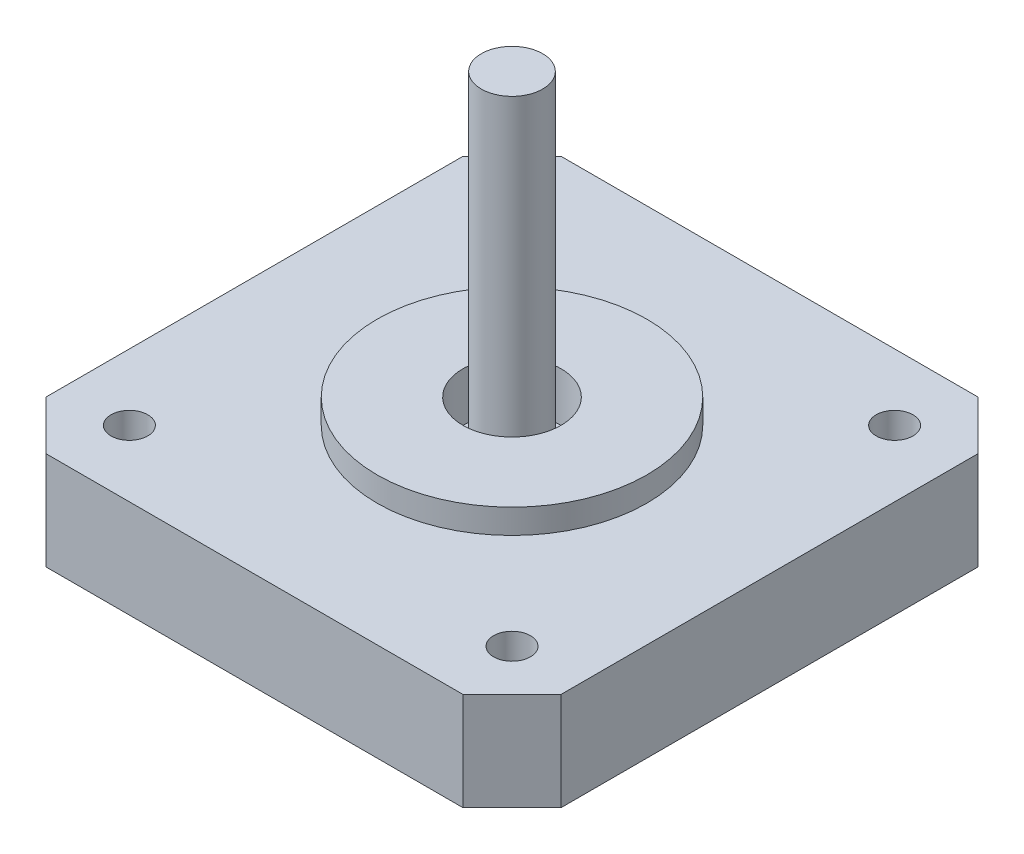
ISO-10303-21;
HEADER;
FILE_DESCRIPTION(('STEP AP214'),'2;1');
FILE_NAME('part.step','',(''),(''),'','','');
FILE_SCHEMA(('AUTOMOTIVE_DESIGN { 1 0 10303 214 1 1 1 1 }'));
ENDSEC;
DATA;
#1=APPLICATION_CONTEXT('core data for automotive mechanical design processes');
#2=APPLICATION_PROTOCOL_DEFINITION('international standard','automotive_design',2000,#1);
#3=PRODUCT_CONTEXT('',#1,'mechanical');
#4=PRODUCT('Part','Part','',(#3));
#5=PRODUCT_RELATED_PRODUCT_CATEGORY('part','',(#4));
#6=PRODUCT_DEFINITION_FORMATION('','',#4);
#7=PRODUCT_DEFINITION_CONTEXT('part definition',#1,'design');
#8=PRODUCT_DEFINITION('design','',#6,#7);
#9=PRODUCT_DEFINITION_SHAPE('','',#8);
#10=(LENGTH_UNIT() NAMED_UNIT(*) SI_UNIT(.MILLI.,.METRE.));
#11=(NAMED_UNIT(*) PLANE_ANGLE_UNIT() SI_UNIT($,.RADIAN.));
#12=(NAMED_UNIT(*) SI_UNIT($,.STERADIAN.) SOLID_ANGLE_UNIT());
#13=UNCERTAINTY_MEASURE_WITH_UNIT(LENGTH_MEASURE(1.E-05),#10,'distance_accuracy_value','');
#14=(GEOMETRIC_REPRESENTATION_CONTEXT(3) GLOBAL_UNCERTAINTY_ASSIGNED_CONTEXT((#13)) GLOBAL_UNIT_ASSIGNED_CONTEXT((#10,
#11,#12)) REPRESENTATION_CONTEXT('',''));
#15=CARTESIAN_POINT('',(0.,0.,0.));
#16=DIRECTION('',(0.,0.,1.));
#17=DIRECTION('',(1.,0.,0.));
#18=AXIS2_PLACEMENT_3D('',#15,#16,#17);
#19=CARTESIAN_POINT('',(0.,6.,0.));
#20=DIRECTION('',(0.,1.,0.));
#21=DIRECTION('',(0.,0.,1.));
#22=AXIS2_PLACEMENT_3D('',#19,#20,#21);
#23=PLANE('',#22);
#24=CARTESIAN_POINT('',(0.,6.,0.));
#25=DIRECTION('',(0.,1.,0.));
#26=DIRECTION('',(0.,0.,1.));
#27=AXIS2_PLACEMENT_3D('',#24,#25,#26);
#28=CIRCLE('',#27,4.);
#29=CARTESIAN_POINT('',(0.,6.,4.));
#30=VERTEX_POINT('',#29);
#31=EDGE_CURVE('E182',#30,#30,#28,.T.);
#32=ORIENTED_EDGE('',*,*,#31,.T.);
#33=EDGE_LOOP('',(#32));
#34=FACE_BOUND('',#33,.T.);
#35=CARTESIAN_POINT('',(0.,6.,0.));
#36=DIRECTION('',(0.,1.,0.));
#37=DIRECTION('',(0.,0.,1.));
#38=AXIS2_PLACEMENT_3D('',#35,#36,#37);
#39=CIRCLE('',#38,2.5);
#40=CARTESIAN_POINT('',(0.,6.,2.5));
#41=VERTEX_POINT('',#40);
#42=EDGE_CURVE('E190',#41,#41,#39,.T.);
#43=ORIENTED_EDGE('',*,*,#42,.F.);
#44=EDGE_LOOP('',(#43));
#45=FACE_BOUND('',#44,.T.);
#46=ADVANCED_FACE('F35',(#34,#45),#23,.T.);
#47=CARTESIAN_POINT('',(-21.,8.,21.));
#48=DIRECTION('',(0.,1.,0.));
#49=DIRECTION('',(0.,0.,1.));
#50=AXIS2_PLACEMENT_3D('',#47,#48,#49);
#51=PLANE('',#50);
#52=CARTESIAN_POINT('',(-15.6,8.,15.6));
#53=DIRECTION('',(0.,1.,0.));
#54=DIRECTION('',(0.,0.,1.));
#55=AXIS2_PLACEMENT_3D('',#52,#53,#54);
#56=CIRCLE('',#55,1.5);
#57=CARTESIAN_POINT('',(-15.6,8.,17.1));
#58=VERTEX_POINT('',#57);
#59=EDGE_CURVE('E213',#58,#58,#56,.T.);
#60=ORIENTED_EDGE('',*,*,#59,.F.);
#61=EDGE_LOOP('',(#60));
#62=FACE_BOUND('',#61,.T.);
#63=CARTESIAN_POINT('',(15.6,8.,15.6));
#64=DIRECTION('',(0.,1.,0.));
#65=DIRECTION('',(0.,0.,1.));
#66=AXIS2_PLACEMENT_3D('',#63,#64,#65);
#67=CIRCLE('',#66,1.5);
#68=CARTESIAN_POINT('',(15.6,8.,17.1));
#69=VERTEX_POINT('',#68);
#70=EDGE_CURVE('E207',#69,#69,#67,.T.);
#71=ORIENTED_EDGE('',*,*,#70,.F.);
#72=EDGE_LOOP('',(#71));
#73=FACE_BOUND('',#72,.T.);
#74=CARTESIAN_POINT('',(15.6,8.,-15.6));
#75=DIRECTION('',(0.,1.,0.));
#76=DIRECTION('',(0.,0.,1.));
#77=AXIS2_PLACEMENT_3D('',#74,#75,#76);
#78=CIRCLE('',#77,1.5);
#79=CARTESIAN_POINT('',(15.6,8.,-14.1));
#80=VERTEX_POINT('',#79);
#81=EDGE_CURVE('E201',#80,#80,#78,.T.);
#82=ORIENTED_EDGE('',*,*,#81,.F.);
#83=EDGE_LOOP('',(#82));
#84=FACE_BOUND('',#83,.T.);
#85=CARTESIAN_POINT('',(-15.6,8.,-15.6));
#86=DIRECTION('',(0.,1.,0.));
#87=DIRECTION('',(0.,0.,1.));
#88=AXIS2_PLACEMENT_3D('',#85,#86,#87);
#89=CIRCLE('',#88,1.5);
#90=CARTESIAN_POINT('',(-15.6,8.,-14.1));
#91=VERTEX_POINT('',#90);
#92=EDGE_CURVE('E193',#91,#91,#89,.T.);
#93=ORIENTED_EDGE('',*,*,#92,.F.);
#94=EDGE_LOOP('',(#93));
#95=FACE_BOUND('',#94,.T.);
#96=DIRECTION('',(-1.,0.,0.));
#97=VECTOR('',#96,1.);
#98=CARTESIAN_POINT('',(-21.,8.,-21.));
#99=LINE('',#98,#97);
#100=CARTESIAN_POINT('',(17.,8.,-21.));
#101=VERTEX_POINT('',#100);
#102=CARTESIAN_POINT('',(-17.,8.,-21.));
#103=VERTEX_POINT('',#102);
#104=EDGE_CURVE('E137',#101,#103,#99,.T.);
#105=ORIENTED_EDGE('',*,*,#104,.T.);
#106=DIRECTION('',(0.707106781186549,0.,-0.707106781186546));
#107=VECTOR('',#106,1.);
#108=CARTESIAN_POINT('',(-40.,8.,1.99999999999993));
#109=LINE('',#108,#107);
#110=CARTESIAN_POINT('',(-21.,8.,-17.));
#111=VERTEX_POINT('',#110);
#112=EDGE_CURVE('E156',#103,#111,#109,.F.);
#113=ORIENTED_EDGE('',*,*,#112,.T.);
#114=DIRECTION('',(0.,0.,1.));
#115=VECTOR('',#114,1.);
#116=CARTESIAN_POINT('',(-21.,8.,-21.));
#117=LINE('',#116,#115);
#118=CARTESIAN_POINT('',(-21.,8.,17.));
#119=VERTEX_POINT('',#118);
#120=EDGE_CURVE('E121',#111,#119,#117,.T.);
#121=ORIENTED_EDGE('',*,*,#120,.T.);
#122=DIRECTION('',(-0.707106781186546,0.,-0.707106781186549));
#123=VECTOR('',#122,1.);
#124=CARTESIAN_POINT('',(-19.,8.,19.));
#125=LINE('',#124,#123);
#126=CARTESIAN_POINT('',(-17.,8.,21.));
#127=VERTEX_POINT('',#126);
#128=EDGE_CURVE('E151',#119,#127,#125,.F.);
#129=ORIENTED_EDGE('',*,*,#128,.T.);
#130=DIRECTION('',(1.,0.,0.));
#131=VECTOR('',#130,1.);
#132=CARTESIAN_POINT('',(-21.,8.,21.));
#133=LINE('',#132,#131);
#134=CARTESIAN_POINT('',(17.,8.,21.));
#135=VERTEX_POINT('',#134);
#136=EDGE_CURVE('E167',#127,#135,#133,.T.);
#137=ORIENTED_EDGE('',*,*,#136,.T.);
#138=DIRECTION('',(-0.707106781186549,0.,0.707106781186546));
#139=VECTOR('',#138,1.);
#140=CARTESIAN_POINT('',(-2.00000000000007,8.,40.));
#141=LINE('',#140,#139);
#142=CARTESIAN_POINT('',(21.,8.,17.));
#143=VERTEX_POINT('',#142);
#144=EDGE_CURVE('E57',#135,#143,#141,.F.);
#145=ORIENTED_EDGE('',*,*,#144,.T.);
#146=DIRECTION('',(0.,0.,-1.));
#147=VECTOR('',#146,1.);
#148=CARTESIAN_POINT('',(21.,8.,-21.));
#149=LINE('',#148,#147);
#150=CARTESIAN_POINT('',(21.,8.,-17.));
#151=VERTEX_POINT('',#150);
#152=EDGE_CURVE('E175',#143,#151,#149,.T.);
#153=ORIENTED_EDGE('',*,*,#152,.T.);
#154=DIRECTION('',(0.707106781186546,0.,0.707106781186549));
#155=VECTOR('',#154,1.);
#156=CARTESIAN_POINT('',(19.0000000000001,8.,-18.9999999999999));
#157=LINE('',#156,#155);
#158=EDGE_CURVE('E154',#151,#101,#157,.F.);
#159=ORIENTED_EDGE('',*,*,#158,.T.);
#160=EDGE_LOOP('',(#105,#113,#121,#129,#137,#145,#153,#159));
#161=FACE_BOUND('',#160,.T.);
#162=CARTESIAN_POINT('',(0.,8.,0.));
#163=DIRECTION('',(0.,1.,0.));
#164=DIRECTION('',(0.,0.,1.));
#165=AXIS2_PLACEMENT_3D('',#162,#163,#164);
#166=CIRCLE('',#165,11.);
#167=CARTESIAN_POINT('',(0.,8.,11.));
#168=VERTEX_POINT('',#167);
#169=EDGE_CURVE('E134',#168,#168,#166,.T.);
#170=ORIENTED_EDGE('',*,*,#169,.F.);
#171=EDGE_LOOP('',(#170));
#172=FACE_BOUND('',#171,.T.);
#173=ADVANCED_FACE('F234',(#62,#73,#84,#95,#161,#172),#51,.T.);
#174=CARTESIAN_POINT('',(-21.,8.,-21.));
#175=DIRECTION('',(1.,0.,0.));
#176=DIRECTION('',(0.,0.,-1.));
#177=AXIS2_PLACEMENT_3D('',#174,#175,#176);
#178=PLANE('',#177);
#179=ORIENTED_EDGE('',*,*,#120,.F.);
#180=DIRECTION('',(0.,-1.,0.));
#181=VECTOR('',#180,1.);
#182=CARTESIAN_POINT('',(-21.,8.,-17.));
#183=LINE('',#182,#181);
#184=CARTESIAN_POINT('',(-21.,0.,-17.));
#185=VERTEX_POINT('',#184);
#186=EDGE_CURVE('E105',#111,#185,#183,.T.);
#187=ORIENTED_EDGE('',*,*,#186,.T.);
#188=DIRECTION('',(0.,0.,1.));
#189=VECTOR('',#188,1.);
#190=CARTESIAN_POINT('',(-21.,0.,-21.));
#191=LINE('',#190,#189);
#192=CARTESIAN_POINT('',(-21.,0.,17.));
#193=VERTEX_POINT('',#192);
#194=EDGE_CURVE('E118',#185,#193,#191,.T.);
#195=ORIENTED_EDGE('',*,*,#194,.T.);
#196=DIRECTION('',(0.,1.,0.));
#197=VECTOR('',#196,1.);
#198=CARTESIAN_POINT('',(-21.,8.,17.));
#199=LINE('',#198,#197);
#200=EDGE_CURVE('E123',#193,#119,#199,.T.);
#201=ORIENTED_EDGE('',*,*,#200,.T.);
#202=EDGE_LOOP('',(#179,#187,#195,#201));
#203=FACE_BOUND('',#202,.T.);
#204=ADVANCED_FACE('F117',(#203),#178,.F.);
#205=CARTESIAN_POINT('',(-21.,8.,21.));
#206=DIRECTION('',(0.,0.,-1.));
#207=DIRECTION('',(-1.,0.,0.));
#208=AXIS2_PLACEMENT_3D('',#205,#206,#207);
#209=PLANE('',#208);
#210=DIRECTION('',(1.,0.,0.));
#211=VECTOR('',#210,1.);
#212=CARTESIAN_POINT('',(-21.,0.,21.));
#213=LINE('',#212,#211);
#214=CARTESIAN_POINT('',(-17.,0.,21.));
#215=VERTEX_POINT('',#214);
#216=CARTESIAN_POINT('',(17.,0.,21.));
#217=VERTEX_POINT('',#216);
#218=EDGE_CURVE('E127',#215,#217,#213,.T.);
#219=ORIENTED_EDGE('',*,*,#218,.T.);
#220=DIRECTION('',(0.,1.,0.));
#221=VECTOR('',#220,1.);
#222=CARTESIAN_POINT('',(17.,8.,21.));
#223=LINE('',#222,#221);
#224=EDGE_CURVE('E11',#217,#135,#223,.T.);
#225=ORIENTED_EDGE('',*,*,#224,.T.);
#226=ORIENTED_EDGE('',*,*,#136,.F.);
#227=DIRECTION('',(0.,-1.,0.));
#228=VECTOR('',#227,1.);
#229=CARTESIAN_POINT('',(-17.,8.,21.));
#230=LINE('',#229,#228);
#231=EDGE_CURVE('E43',#127,#215,#230,.T.);
#232=ORIENTED_EDGE('',*,*,#231,.T.);
#233=EDGE_LOOP('',(#219,#225,#226,#232));
#234=FACE_BOUND('',#233,.T.);
#235=ADVANCED_FACE('F165',(#234),#209,.F.);
#236=CARTESIAN_POINT('',(21.,8.,-21.));
#237=DIRECTION('',(-1.,0.,0.));
#238=DIRECTION('',(0.,0.,1.));
#239=AXIS2_PLACEMENT_3D('',#236,#237,#238);
#240=PLANE('',#239);
#241=DIRECTION('',(0.,0.,-1.));
#242=VECTOR('',#241,1.);
#243=CARTESIAN_POINT('',(21.,0.,-21.));
#244=LINE('',#243,#242);
#245=CARTESIAN_POINT('',(21.,0.,17.));
#246=VERTEX_POINT('',#245);
#247=CARTESIAN_POINT('',(21.,0.,-17.));
#248=VERTEX_POINT('',#247);
#249=EDGE_CURVE('E131',#246,#248,#244,.T.);
#250=ORIENTED_EDGE('',*,*,#249,.T.);
#251=DIRECTION('',(0.,1.,0.));
#252=VECTOR('',#251,1.);
#253=CARTESIAN_POINT('',(21.,8.,-17.));
#254=LINE('',#253,#252);
#255=EDGE_CURVE('E50',#248,#151,#254,.T.);
#256=ORIENTED_EDGE('',*,*,#255,.T.);
#257=ORIENTED_EDGE('',*,*,#152,.F.);
#258=DIRECTION('',(0.,-1.,0.));
#259=VECTOR('',#258,1.);
#260=CARTESIAN_POINT('',(21.,8.,17.));
#261=LINE('',#260,#259);
#262=EDGE_CURVE('E158',#143,#246,#261,.T.);
#263=ORIENTED_EDGE('',*,*,#262,.T.);
#264=EDGE_LOOP('',(#250,#256,#257,#263));
#265=FACE_BOUND('',#264,.T.);
#266=ADVANCED_FACE('F174',(#265),#240,.F.);
#267=CARTESIAN_POINT('',(-21.,8.,-21.));
#268=DIRECTION('',(0.,0.,1.));
#269=DIRECTION('',(1.,0.,0.));
#270=AXIS2_PLACEMENT_3D('',#267,#268,#269);
#271=PLANE('',#270);
#272=DIRECTION('',(-1.,0.,0.));
#273=VECTOR('',#272,1.);
#274=CARTESIAN_POINT('',(-21.,0.,-21.));
#275=LINE('',#274,#273);
#276=CARTESIAN_POINT('',(17.,0.,-21.));
#277=VERTEX_POINT('',#276);
#278=CARTESIAN_POINT('',(-17.,0.,-21.));
#279=VERTEX_POINT('',#278);
#280=EDGE_CURVE('E141',#277,#279,#275,.T.);
#281=ORIENTED_EDGE('',*,*,#280,.T.);
#282=DIRECTION('',(0.,1.,0.));
#283=VECTOR('',#282,1.);
#284=CARTESIAN_POINT('',(-17.,8.,-21.));
#285=LINE('',#284,#283);
#286=EDGE_CURVE('E106',#279,#103,#285,.T.);
#287=ORIENTED_EDGE('',*,*,#286,.T.);
#288=ORIENTED_EDGE('',*,*,#104,.F.);
#289=DIRECTION('',(0.,-1.,0.));
#290=VECTOR('',#289,1.);
#291=CARTESIAN_POINT('',(17.,8.,-21.));
#292=LINE('',#291,#290);
#293=EDGE_CURVE('E111',#101,#277,#292,.T.);
#294=ORIENTED_EDGE('',*,*,#293,.T.);
#295=EDGE_LOOP('',(#281,#287,#288,#294));
#296=FACE_BOUND('',#295,.T.);
#297=ADVANCED_FACE('F262',(#296),#271,.F.);
#298=CARTESIAN_POINT('',(-21.,0.,21.));
#299=DIRECTION('',(0.,1.,0.));
#300=DIRECTION('',(0.,0.,1.));
#301=AXIS2_PLACEMENT_3D('',#298,#299,#300);
#302=PLANE('',#301);
#303=CARTESIAN_POINT('',(-15.6,0.,15.6));
#304=DIRECTION('',(0.,1.,0.));
#305=DIRECTION('',(0.,0.,1.));
#306=AXIS2_PLACEMENT_3D('',#303,#304,#305);
#307=CIRCLE('',#306,1.5);
#308=CARTESIAN_POINT('',(-15.6,0.,17.1));
#309=VERTEX_POINT('',#308);
#310=EDGE_CURVE('E216',#309,#309,#307,.T.);
#311=ORIENTED_EDGE('',*,*,#310,.T.);
#312=EDGE_LOOP('',(#311));
#313=FACE_BOUND('',#312,.T.);
#314=CARTESIAN_POINT('',(15.6,0.,15.6));
#315=DIRECTION('',(0.,1.,0.));
#316=DIRECTION('',(0.,0.,1.));
#317=AXIS2_PLACEMENT_3D('',#314,#315,#316);
#318=CIRCLE('',#317,1.5);
#319=CARTESIAN_POINT('',(15.6,0.,17.1));
#320=VERTEX_POINT('',#319);
#321=EDGE_CURVE('E210',#320,#320,#318,.T.);
#322=ORIENTED_EDGE('',*,*,#321,.T.);
#323=EDGE_LOOP('',(#322));
#324=FACE_BOUND('',#323,.T.);
#325=CARTESIAN_POINT('',(15.6,0.,-15.6));
#326=DIRECTION('',(0.,1.,0.));
#327=DIRECTION('',(0.,0.,1.));
#328=AXIS2_PLACEMENT_3D('',#325,#326,#327);
#329=CIRCLE('',#328,1.5);
#330=CARTESIAN_POINT('',(15.6,0.,-14.1));
#331=VERTEX_POINT('',#330);
#332=EDGE_CURVE('E204',#331,#331,#329,.T.);
#333=ORIENTED_EDGE('',*,*,#332,.T.);
#334=EDGE_LOOP('',(#333));
#335=FACE_BOUND('',#334,.T.);
#336=CARTESIAN_POINT('',(-15.6,0.,-15.6));
#337=DIRECTION('',(0.,1.,0.));
#338=DIRECTION('',(0.,0.,1.));
#339=AXIS2_PLACEMENT_3D('',#336,#337,#338);
#340=CIRCLE('',#339,1.5);
#341=CARTESIAN_POINT('',(-15.6,0.,-14.1));
#342=VERTEX_POINT('',#341);
#343=EDGE_CURVE('E198',#342,#342,#340,.T.);
#344=ORIENTED_EDGE('',*,*,#343,.T.);
#345=EDGE_LOOP('',(#344));
#346=FACE_BOUND('',#345,.T.);
#347=ORIENTED_EDGE('',*,*,#194,.F.);
#348=DIRECTION('',(-0.707106781186549,0.,0.707106781186546));
#349=VECTOR('',#348,1.);
#350=CARTESIAN_POINT('',(-21.,0.,-17.));
#351=LINE('',#350,#349);
#352=EDGE_CURVE('E101',#185,#279,#351,.F.);
#353=ORIENTED_EDGE('',*,*,#352,.T.);
#354=ORIENTED_EDGE('',*,*,#280,.F.);
#355=DIRECTION('',(-0.707106781186546,0.,-0.707106781186549));
#356=VECTOR('',#355,1.);
#357=CARTESIAN_POINT('',(17.,0.,-21.));
#358=LINE('',#357,#356);
#359=EDGE_CURVE('E112',#277,#248,#358,.F.);
#360=ORIENTED_EDGE('',*,*,#359,.T.);
#361=ORIENTED_EDGE('',*,*,#249,.F.);
#362=DIRECTION('',(0.707106781186549,0.,-0.707106781186546));
#363=VECTOR('',#362,1.);
#364=CARTESIAN_POINT('',(21.,0.,17.));
#365=LINE('',#364,#363);
#366=EDGE_CURVE('E145',#246,#217,#365,.F.);
#367=ORIENTED_EDGE('',*,*,#366,.T.);
#368=ORIENTED_EDGE('',*,*,#218,.F.);
#369=DIRECTION('',(0.707106781186546,0.,0.707106781186549));
#370=VECTOR('',#369,1.);
#371=CARTESIAN_POINT('',(-17.,0.,21.));
#372=LINE('',#371,#370);
#373=EDGE_CURVE('E122',#215,#193,#372,.F.);
#374=ORIENTED_EDGE('',*,*,#373,.T.);
#375=EDGE_LOOP('',(#347,#353,#354,#360,#361,#367,#368,#374));
#376=FACE_BOUND('',#375,.T.);
#377=ADVANCED_FACE('F125',(#313,#324,#335,#346,#376),#302,.F.);
#378=CARTESIAN_POINT('',(0.,10.,0.));
#379=DIRECTION('',(0.,-1.,0.));
#380=DIRECTION('',(0.,0.,-1.));
#381=AXIS2_PLACEMENT_3D('',#378,#379,#380);
#382=CYLINDRICAL_SURFACE('',#381,11.);
#383=CARTESIAN_POINT('',(0.,10.,0.));
#384=DIRECTION('',(0.,1.,0.));
#385=DIRECTION('',(0.,0.,1.));
#386=AXIS2_PLACEMENT_3D('',#383,#384,#385);
#387=CIRCLE('',#386,11.);
#388=CARTESIAN_POINT('',(0.,10.,11.));
#389=VERTEX_POINT('',#388);
#390=EDGE_CURVE('E128',#389,#389,#387,.T.);
#391=ORIENTED_EDGE('',*,*,#390,.F.);
#392=EDGE_LOOP('',(#391));
#393=FACE_BOUND('',#392,.T.);
#394=ORIENTED_EDGE('',*,*,#169,.T.);
#395=EDGE_LOOP('',(#394));
#396=FACE_BOUND('',#395,.T.);
#397=ADVANCED_FACE('F255',(#393,#396),#382,.T.);
#398=CARTESIAN_POINT('',(0.,10.,0.));
#399=DIRECTION('',(0.,1.,0.));
#400=DIRECTION('',(0.,0.,1.));
#401=AXIS2_PLACEMENT_3D('',#398,#399,#400);
#402=PLANE('',#401);
#403=CARTESIAN_POINT('',(0.,10.,0.));
#404=DIRECTION('',(0.,1.,0.));
#405=DIRECTION('',(0.,0.,1.));
#406=AXIS2_PLACEMENT_3D('',#403,#404,#405);
#407=CIRCLE('',#406,4.);
#408=CARTESIAN_POINT('',(0.,10.,4.));
#409=VERTEX_POINT('',#408);
#410=EDGE_CURVE('E184',#409,#409,#407,.T.);
#411=ORIENTED_EDGE('',*,*,#410,.F.);
#412=EDGE_LOOP('',(#411));
#413=FACE_BOUND('',#412,.T.);
#414=ORIENTED_EDGE('',*,*,#390,.T.);
#415=EDGE_LOOP('',(#414));
#416=FACE_BOUND('',#415,.T.);
#417=ADVANCED_FACE('F251',(#413,#416),#402,.T.);
#418=CARTESIAN_POINT('',(0.,6.,0.));
#419=DIRECTION('',(0.,1.,0.));
#420=DIRECTION('',(0.,0.,1.));
#421=AXIS2_PLACEMENT_3D('',#418,#419,#420);
#422=CYLINDRICAL_SURFACE('',#421,4.);
#423=ORIENTED_EDGE('',*,*,#31,.F.);
#424=EDGE_LOOP('',(#423));
#425=FACE_BOUND('',#424,.T.);
#426=ORIENTED_EDGE('',*,*,#410,.T.);
#427=EDGE_LOOP('',(#426));
#428=FACE_BOUND('',#427,.T.);
#429=ADVANCED_FACE('F248',(#425,#428),#422,.F.);
#430=CARTESIAN_POINT('',(0.,33.,0.));
#431=DIRECTION('',(0.,-1.,0.));
#432=DIRECTION('',(0.,0.,-1.));
#433=AXIS2_PLACEMENT_3D('',#430,#431,#432);
#434=CYLINDRICAL_SURFACE('',#433,2.5);
#435=CARTESIAN_POINT('',(0.,33.,0.));
#436=DIRECTION('',(0.,1.,0.));
#437=DIRECTION('',(0.,0.,1.));
#438=AXIS2_PLACEMENT_3D('',#435,#436,#437);
#439=CIRCLE('',#438,2.5);
#440=CARTESIAN_POINT('',(0.,33.,2.5));
#441=VERTEX_POINT('',#440);
#442=EDGE_CURVE('E187',#441,#441,#439,.T.);
#443=ORIENTED_EDGE('',*,*,#442,.F.);
#444=EDGE_LOOP('',(#443));
#445=FACE_BOUND('',#444,.T.);
#446=ORIENTED_EDGE('',*,*,#42,.T.);
#447=EDGE_LOOP('',(#446));
#448=FACE_BOUND('',#447,.T.);
#449=ADVANCED_FACE('F246',(#445,#448),#434,.T.);
#450=CARTESIAN_POINT('',(0.,33.,0.));
#451=DIRECTION('',(0.,1.,0.));
#452=DIRECTION('',(0.,0.,1.));
#453=AXIS2_PLACEMENT_3D('',#450,#451,#452);
#454=PLANE('',#453);
#455=ORIENTED_EDGE('',*,*,#442,.T.);
#456=EDGE_LOOP('',(#455));
#457=FACE_BOUND('',#456,.T.);
#458=ADVANCED_FACE('F275',(#457),#454,.T.);
#459=CARTESIAN_POINT('',(-21.,8.,-17.));
#460=DIRECTION('',(0.707106781186546,0.,0.707106781186549));
#461=DIRECTION('',(0.707106781186549,0.,-0.707106781186546));
#462=AXIS2_PLACEMENT_3D('',#459,#460,#461);
#463=PLANE('',#462);
#464=ORIENTED_EDGE('',*,*,#112,.F.);
#465=ORIENTED_EDGE('',*,*,#286,.F.);
#466=ORIENTED_EDGE('',*,*,#352,.F.);
#467=ORIENTED_EDGE('',*,*,#186,.F.);
#468=EDGE_LOOP('',(#464,#465,#466,#467));
#469=FACE_BOUND('',#468,.T.);
#470=ADVANCED_FACE('F104',(#469),#463,.F.);
#471=CARTESIAN_POINT('',(17.,8.,-21.));
#472=DIRECTION('',(-0.707106781186549,0.,0.707106781186546));
#473=DIRECTION('',(0.707106781186546,0.,0.707106781186549));
#474=AXIS2_PLACEMENT_3D('',#471,#472,#473);
#475=PLANE('',#474);
#476=ORIENTED_EDGE('',*,*,#158,.F.);
#477=ORIENTED_EDGE('',*,*,#255,.F.);
#478=ORIENTED_EDGE('',*,*,#359,.F.);
#479=ORIENTED_EDGE('',*,*,#293,.F.);
#480=EDGE_LOOP('',(#476,#477,#478,#479));
#481=FACE_BOUND('',#480,.T.);
#482=ADVANCED_FACE('F274',(#481),#475,.F.);
#483=CARTESIAN_POINT('',(21.,8.,17.));
#484=DIRECTION('',(-0.707106781186546,0.,-0.707106781186549));
#485=DIRECTION('',(-0.707106781186549,0.,0.707106781186546));
#486=AXIS2_PLACEMENT_3D('',#483,#484,#485);
#487=PLANE('',#486);
#488=ORIENTED_EDGE('',*,*,#144,.F.);
#489=ORIENTED_EDGE('',*,*,#224,.F.);
#490=ORIENTED_EDGE('',*,*,#366,.F.);
#491=ORIENTED_EDGE('',*,*,#262,.F.);
#492=EDGE_LOOP('',(#488,#489,#490,#491));
#493=FACE_BOUND('',#492,.T.);
#494=ADVANCED_FACE('F173',(#493),#487,.F.);
#495=CARTESIAN_POINT('',(-17.,8.,21.));
#496=DIRECTION('',(0.707106781186549,0.,-0.707106781186546));
#497=DIRECTION('',(-0.707106781186546,0.,-0.707106781186549));
#498=AXIS2_PLACEMENT_3D('',#495,#496,#497);
#499=PLANE('',#498);
#500=ORIENTED_EDGE('',*,*,#128,.F.);
#501=ORIENTED_EDGE('',*,*,#200,.F.);
#502=ORIENTED_EDGE('',*,*,#373,.F.);
#503=ORIENTED_EDGE('',*,*,#231,.F.);
#504=EDGE_LOOP('',(#500,#501,#502,#503));
#505=FACE_BOUND('',#504,.T.);
#506=ADVANCED_FACE('F37',(#505),#499,.F.);
#507=CARTESIAN_POINT('',(-15.6,0.,-15.6));
#508=DIRECTION('',(0.,1.,0.));
#509=DIRECTION('',(0.,0.,1.));
#510=AXIS2_PLACEMENT_3D('',#507,#508,#509);
#511=CYLINDRICAL_SURFACE('',#510,1.5);
#512=ORIENTED_EDGE('',*,*,#92,.T.);
#513=EDGE_LOOP('',(#512));
#514=FACE_BOUND('',#513,.T.);
#515=ORIENTED_EDGE('',*,*,#343,.F.);
#516=EDGE_LOOP('',(#515));
#517=FACE_BOUND('',#516,.T.);
#518=ADVANCED_FACE('F282',(#514,#517),#511,.F.);
#519=CARTESIAN_POINT('',(15.6,0.,-15.6));
#520=DIRECTION('',(0.,1.,0.));
#521=DIRECTION('',(0.,0.,1.));
#522=AXIS2_PLACEMENT_3D('',#519,#520,#521);
#523=CYLINDRICAL_SURFACE('',#522,1.5);
#524=ORIENTED_EDGE('',*,*,#81,.T.);
#525=EDGE_LOOP('',(#524));
#526=FACE_BOUND('',#525,.T.);
#527=ORIENTED_EDGE('',*,*,#332,.F.);
#528=EDGE_LOOP('',(#527));
#529=FACE_BOUND('',#528,.T.);
#530=ADVANCED_FACE('F230',(#526,#529),#523,.F.);
#531=CARTESIAN_POINT('',(15.6,0.,15.6));
#532=DIRECTION('',(0.,1.,0.));
#533=DIRECTION('',(0.,0.,1.));
#534=AXIS2_PLACEMENT_3D('',#531,#532,#533);
#535=CYLINDRICAL_SURFACE('',#534,1.5);
#536=ORIENTED_EDGE('',*,*,#70,.T.);
#537=EDGE_LOOP('',(#536));
#538=FACE_BOUND('',#537,.T.);
#539=ORIENTED_EDGE('',*,*,#321,.F.);
#540=EDGE_LOOP('',(#539));
#541=FACE_BOUND('',#540,.T.);
#542=ADVANCED_FACE('F224',(#538,#541),#535,.F.);
#543=CARTESIAN_POINT('',(-15.6,0.,15.6));
#544=DIRECTION('',(0.,1.,0.));
#545=DIRECTION('',(0.,0.,1.));
#546=AXIS2_PLACEMENT_3D('',#543,#544,#545);
#547=CYLINDRICAL_SURFACE('',#546,1.5);
#548=ORIENTED_EDGE('',*,*,#59,.T.);
#549=EDGE_LOOP('',(#548));
#550=FACE_BOUND('',#549,.T.);
#551=ORIENTED_EDGE('',*,*,#310,.F.);
#552=EDGE_LOOP('',(#551));
#553=FACE_BOUND('',#552,.T.);
#554=ADVANCED_FACE('F222',(#550,#553),#547,.F.);
#555=CLOSED_SHELL('',(#46,#173,#204,#235,#266,#297,#377,#397,#417,#429,#449,#458,#470,#482,#494,
#506,#518,#530,#542,#554));
#556=MANIFOLD_SOLID_BREP('B2',#555);
#557=ADVANCED_BREP_SHAPE_REPRESENTATION('',(#18,#556),#14);
#558=SHAPE_DEFINITION_REPRESENTATION(#9,#557);
ENDSEC;
END-ISO-10303-21;
